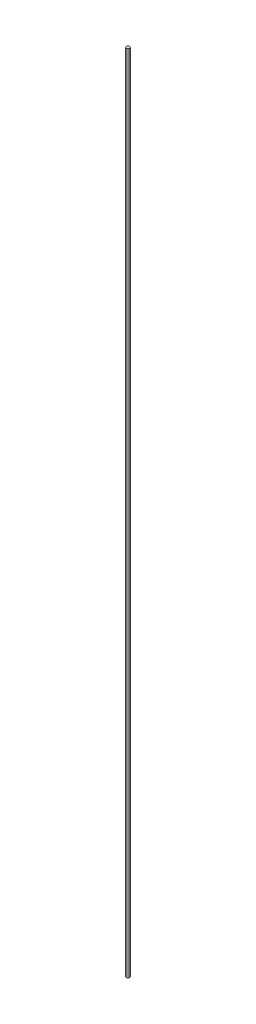
ISO-10303-21;
HEADER;
FILE_DESCRIPTION(('STEP AP214'),'2;1');
FILE_NAME('part.step','',(''),(''),'','','');
FILE_SCHEMA(('AUTOMOTIVE_DESIGN { 1 0 10303 214 1 1 1 1 }'));
ENDSEC;
DATA;
#1=APPLICATION_CONTEXT('core data for automotive mechanical design processes');
#2=APPLICATION_PROTOCOL_DEFINITION('international standard','automotive_design',2000,#1);
#3=PRODUCT_CONTEXT('',#1,'mechanical');
#4=PRODUCT('Part','Part','',(#3));
#5=PRODUCT_RELATED_PRODUCT_CATEGORY('part','',(#4));
#6=PRODUCT_DEFINITION_FORMATION('','',#4);
#7=PRODUCT_DEFINITION_CONTEXT('part definition',#1,'design');
#8=PRODUCT_DEFINITION('design','',#6,#7);
#9=PRODUCT_DEFINITION_SHAPE('','',#8);
#10=(LENGTH_UNIT() NAMED_UNIT(*) SI_UNIT(.MILLI.,.METRE.));
#11=(NAMED_UNIT(*) PLANE_ANGLE_UNIT() SI_UNIT($,.RADIAN.));
#12=(NAMED_UNIT(*) SI_UNIT($,.STERADIAN.) SOLID_ANGLE_UNIT());
#13=UNCERTAINTY_MEASURE_WITH_UNIT(LENGTH_MEASURE(1.E-05),#10,'distance_accuracy_value','');
#14=(GEOMETRIC_REPRESENTATION_CONTEXT(3) GLOBAL_UNCERTAINTY_ASSIGNED_CONTEXT((#13)) GLOBAL_UNIT_ASSIGNED_CONTEXT((#10,
#11,#12)) REPRESENTATION_CONTEXT('',''));
#15=CARTESIAN_POINT('',(0.,0.,0.));
#16=DIRECTION('',(0.,0.,1.));
#17=DIRECTION('',(1.,0.,0.));
#18=AXIS2_PLACEMENT_3D('',#15,#16,#17);
#19=CARTESIAN_POINT('',(0.,155.,0.));
#20=DIRECTION('',(0.,-1.,0.));
#21=DIRECTION('',(0.,0.,-1.));
#22=AXIS2_PLACEMENT_3D('',#19,#20,#21);
#23=CYLINDRICAL_SURFACE('',#22,0.3225);
#24=CARTESIAN_POINT('',(0.,155.,0.));
#25=DIRECTION('',(0.,1.,0.));
#26=DIRECTION('',(0.,0.,1.));
#27=AXIS2_PLACEMENT_3D('',#24,#25,#26);
#28=CIRCLE('',#27,0.3225);
#29=CARTESIAN_POINT('',(0.,155.,0.3225));
#30=VERTEX_POINT('',#29);
#31=EDGE_CURVE('E10',#30,#30,#28,.T.);
#32=ORIENTED_EDGE('',*,*,#31,.F.);
#33=EDGE_LOOP('',(#32));
#34=FACE_BOUND('',#33,.T.);
#35=CARTESIAN_POINT('',(0.,0.,0.));
#36=DIRECTION('',(0.,1.,0.));
#37=DIRECTION('',(0.,0.,1.));
#38=AXIS2_PLACEMENT_3D('',#35,#36,#37);
#39=CIRCLE('',#38,0.3225);
#40=CARTESIAN_POINT('',(0.,0.,0.3225));
#41=VERTEX_POINT('',#40);
#42=EDGE_CURVE('E36',#41,#41,#39,.T.);
#43=ORIENTED_EDGE('',*,*,#42,.T.);
#44=EDGE_LOOP('',(#43));
#45=FACE_BOUND('',#44,.T.);
#46=ADVANCED_FACE('F33',(#34,#45),#23,.T.);
#47=CARTESIAN_POINT('',(0.,155.,0.));
#48=DIRECTION('',(0.,1.,0.));
#49=DIRECTION('',(0.,0.,1.));
#50=AXIS2_PLACEMENT_3D('',#47,#48,#49);
#51=PLANE('',#50);
#52=ORIENTED_EDGE('',*,*,#31,.T.);
#53=EDGE_LOOP('',(#52));
#54=FACE_BOUND('',#53,.T.);
#55=ADVANCED_FACE('F48',(#54),#51,.T.);
#56=CARTESIAN_POINT('',(0.,0.,0.));
#57=DIRECTION('',(0.,1.,0.));
#58=DIRECTION('',(0.,0.,1.));
#59=AXIS2_PLACEMENT_3D('',#56,#57,#58);
#60=PLANE('',#59);
#61=ORIENTED_EDGE('',*,*,#42,.F.);
#62=EDGE_LOOP('',(#61));
#63=FACE_BOUND('',#62,.T.);
#64=ADVANCED_FACE('F46',(#63),#60,.F.);
#65=CLOSED_SHELL('',(#46,#55,#64));
#66=MANIFOLD_SOLID_BREP('B2',#65);
#67=ADVANCED_BREP_SHAPE_REPRESENTATION('',(#18,#66),#14);
#68=SHAPE_DEFINITION_REPRESENTATION(#9,#67);
ENDSEC;
END-ISO-10303-21;
